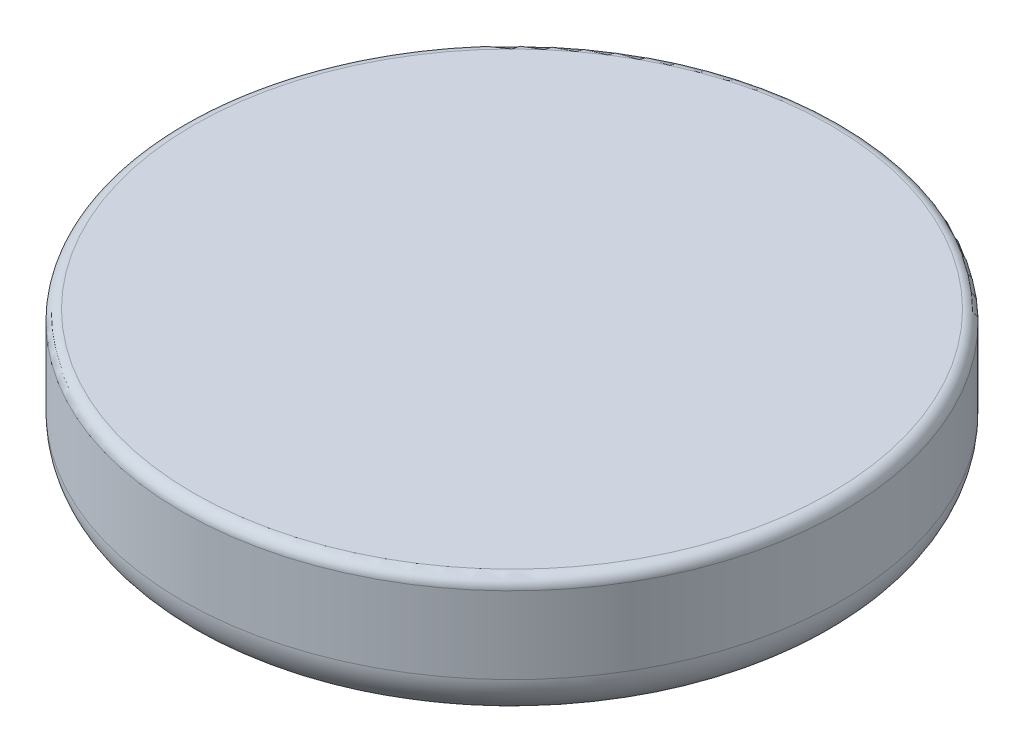
ISO-10303-21;
HEADER;
FILE_DESCRIPTION(('STEP AP214'),'2;1');
FILE_NAME('part.step','',(''),(''),'','','');
FILE_SCHEMA(('AUTOMOTIVE_DESIGN { 1 0 10303 214 1 1 1 1 }'));
ENDSEC;
DATA;
#1=APPLICATION_CONTEXT('core data for automotive mechanical design processes');
#2=APPLICATION_PROTOCOL_DEFINITION('international standard','automotive_design',2000,#1);
#3=PRODUCT_CONTEXT('',#1,'mechanical');
#4=PRODUCT('Part','Part','',(#3));
#5=PRODUCT_RELATED_PRODUCT_CATEGORY('part','',(#4));
#6=PRODUCT_DEFINITION_FORMATION('','',#4);
#7=PRODUCT_DEFINITION_CONTEXT('part definition',#1,'design');
#8=PRODUCT_DEFINITION('design','',#6,#7);
#9=PRODUCT_DEFINITION_SHAPE('','',#8);
#10=(LENGTH_UNIT() NAMED_UNIT(*) SI_UNIT(.MILLI.,.METRE.));
#11=(NAMED_UNIT(*) PLANE_ANGLE_UNIT() SI_UNIT($,.RADIAN.));
#12=(NAMED_UNIT(*) SI_UNIT($,.STERADIAN.) SOLID_ANGLE_UNIT());
#13=UNCERTAINTY_MEASURE_WITH_UNIT(LENGTH_MEASURE(1.E-05),#10,'distance_accuracy_value','');
#14=(GEOMETRIC_REPRESENTATION_CONTEXT(3) GLOBAL_UNCERTAINTY_ASSIGNED_CONTEXT((#13)) GLOBAL_UNIT_ASSIGNED_CONTEXT((#10,
#11,#12)) REPRESENTATION_CONTEXT('',''));
#15=CARTESIAN_POINT('',(0.,0.,0.));
#16=DIRECTION('',(0.,0.,1.));
#17=DIRECTION('',(1.,0.,0.));
#18=AXIS2_PLACEMENT_3D('',#15,#16,#17);
#19=CARTESIAN_POINT('',(0.,3.,0.));
#20=DIRECTION('',(0.,-1.,0.));
#21=DIRECTION('',(0.,0.,-1.));
#22=AXIS2_PLACEMENT_3D('',#19,#20,#21);
#23=CYLINDRICAL_SURFACE('',#22,7.5);
#24=CARTESIAN_POINT('',(0.,2.75,0.));
#25=DIRECTION('',(0.,1.,0.));
#26=DIRECTION('',(0.,0.,1.));
#27=AXIS2_PLACEMENT_3D('',#24,#25,#26);
#28=CIRCLE('',#27,7.5);
#29=CARTESIAN_POINT('',(0.,2.75,7.5));
#30=VERTEX_POINT('',#29);
#31=EDGE_CURVE('E156',#30,#30,#28,.F.);
#32=ORIENTED_EDGE('',*,*,#31,.T.);
#33=EDGE_LOOP('',(#32));
#34=FACE_BOUND('',#33,.T.);
#35=CARTESIAN_POINT('',(0.,1.,0.));
#36=DIRECTION('',(0.,1.,0.));
#37=DIRECTION('',(0.,0.,1.));
#38=AXIS2_PLACEMENT_3D('',#35,#36,#37);
#39=CIRCLE('',#38,7.5);
#40=CARTESIAN_POINT('',(0.,1.,7.5));
#41=VERTEX_POINT('',#40);
#42=EDGE_CURVE('E138',#41,#41,#39,.T.);
#43=ORIENTED_EDGE('',*,*,#42,.T.);
#44=EDGE_LOOP('',(#43));
#45=FACE_BOUND('',#44,.T.);
#46=ADVANCED_FACE('F43',(#34,#45),#23,.T.);
#47=CARTESIAN_POINT('',(0.,3.,0.));
#48=DIRECTION('',(0.,1.,0.));
#49=DIRECTION('',(0.,0.,1.));
#50=AXIS2_PLACEMENT_3D('',#47,#48,#49);
#51=PLANE('',#50);
#52=CARTESIAN_POINT('',(0.,3.,0.));
#53=DIRECTION('',(0.,1.,0.));
#54=DIRECTION('',(0.,0.,1.));
#55=AXIS2_PLACEMENT_3D('',#52,#53,#54);
#56=CIRCLE('',#55,7.25);
#57=CARTESIAN_POINT('',(0.,3.,7.25));
#58=VERTEX_POINT('',#57);
#59=EDGE_CURVE('E152',#58,#58,#56,.T.);
#60=ORIENTED_EDGE('',*,*,#59,.T.);
#61=EDGE_LOOP('',(#60));
#62=FACE_BOUND('',#61,.T.);
#63=ADVANCED_FACE('F197',(#62),#51,.T.);
#64=CARTESIAN_POINT('',(0.,0.,0.));
#65=DIRECTION('',(0.,1.,0.));
#66=DIRECTION('',(0.,0.,1.));
#67=AXIS2_PLACEMENT_3D('',#64,#65,#66);
#68=PLANE('',#67);
#69=DIRECTION('',(1.,0.,0.));
#70=VECTOR('',#69,1.);
#71=CARTESIAN_POINT('',(0.7,0.,-2.55));
#72=LINE('',#71,#70);
#73=CARTESIAN_POINT('',(-0.95,0.,-2.55));
#74=VERTEX_POINT('',#73);
#75=CARTESIAN_POINT('',(0.95,0.,-2.55));
#76=VERTEX_POINT('',#75);
#77=EDGE_CURVE('E126',#74,#76,#72,.T.);
#78=ORIENTED_EDGE('',*,*,#77,.F.);
#79=DIRECTION('',(0.,0.,-1.));
#80=VECTOR('',#79,1.);
#81=CARTESIAN_POINT('',(-0.95,0.,0.));
#82=LINE('',#81,#80);
#83=CARTESIAN_POINT('',(-0.950000000000001,0.,2.55));
#84=VERTEX_POINT('',#83);
#85=EDGE_CURVE('E166',#74,#84,#82,.F.);
#86=ORIENTED_EDGE('',*,*,#85,.T.);
#87=DIRECTION('',(-1.,0.,0.));
#88=VECTOR('',#87,1.);
#89=CARTESIAN_POINT('',(0.7,0.,2.55));
#90=LINE('',#89,#88);
#91=CARTESIAN_POINT('',(0.95,0.,2.55));
#92=VERTEX_POINT('',#91);
#93=EDGE_CURVE('E123',#92,#84,#90,.T.);
#94=ORIENTED_EDGE('',*,*,#93,.F.);
#95=DIRECTION('',(0.,0.,1.));
#96=VECTOR('',#95,1.);
#97=CARTESIAN_POINT('',(0.95,0.,0.));
#98=LINE('',#97,#96);
#99=EDGE_CURVE('E162',#92,#76,#98,.F.);
#100=ORIENTED_EDGE('',*,*,#99,.T.);
#101=EDGE_LOOP('',(#78,#86,#94,#100));
#102=FACE_BOUND('',#101,.T.);
#103=CARTESIAN_POINT('',(0.,0.,0.));
#104=DIRECTION('',(0.,1.,0.));
#105=DIRECTION('',(0.,0.,1.));
#106=AXIS2_PLACEMENT_3D('',#103,#104,#105);
#107=CIRCLE('',#106,6.5);
#108=CARTESIAN_POINT('',(0.,0.,6.5));
#109=VERTEX_POINT('',#108);
#110=EDGE_CURVE('E148',#109,#109,#107,.F.);
#111=ORIENTED_EDGE('',*,*,#110,.T.);
#112=EDGE_LOOP('',(#111));
#113=FACE_BOUND('',#112,.T.);
#114=ADVANCED_FACE('F182',(#102,#113),#68,.F.);
#115=CARTESIAN_POINT('',(0.,1.,0.));
#116=DIRECTION('',(0.,1.,0.));
#117=DIRECTION('',(0.,0.,1.));
#118=AXIS2_PLACEMENT_3D('',#115,#116,#117);
#119=TOROIDAL_SURFACE('',#118,6.5,1.);
#120=ORIENTED_EDGE('',*,*,#110,.F.);
#121=EDGE_LOOP('',(#120));
#122=FACE_BOUND('',#121,.T.);
#123=ORIENTED_EDGE('',*,*,#42,.F.);
#124=EDGE_LOOP('',(#123));
#125=FACE_BOUND('',#124,.T.);
#126=ADVANCED_FACE('F208',(#122,#125),#119,.T.);
#127=CARTESIAN_POINT('',(-0.700000000000001,2.,2.55));
#128=DIRECTION('',(-1.,0.,0.));
#129=DIRECTION('',(0.,0.,1.));
#130=AXIS2_PLACEMENT_3D('',#127,#128,#129);
#131=PLANE('',#130);
#132=DIRECTION('',(0.,-1.,0.));
#133=VECTOR('',#132,1.);
#134=CARTESIAN_POINT('',(-0.700000000000001,2.,2.55));
#135=LINE('',#134,#133);
#136=CARTESIAN_POINT('',(-0.700000000000001,2.,2.55));
#137=VERTEX_POINT('',#136);
#138=CARTESIAN_POINT('',(-0.700000000000001,0.25,2.55));
#139=VERTEX_POINT('',#138);
#140=EDGE_CURVE('E135',#137,#139,#135,.T.);
#141=ORIENTED_EDGE('',*,*,#140,.T.);
#142=DIRECTION('',(0.,0.,-1.));
#143=VECTOR('',#142,1.);
#144=CARTESIAN_POINT('',(-0.700000000000001,0.25,2.55));
#145=LINE('',#144,#143);
#146=CARTESIAN_POINT('',(-0.7,0.25,-2.55));
#147=VERTEX_POINT('',#146);
#148=EDGE_CURVE('E105',#139,#147,#145,.T.);
#149=ORIENTED_EDGE('',*,*,#148,.T.);
#150=DIRECTION('',(0.,-1.,0.));
#151=VECTOR('',#150,1.);
#152=CARTESIAN_POINT('',(-0.7,2.,-2.55));
#153=LINE('',#152,#151);
#154=CARTESIAN_POINT('',(-0.7,2.,-2.55));
#155=VERTEX_POINT('',#154);
#156=EDGE_CURVE('E97',#155,#147,#153,.T.);
#157=ORIENTED_EDGE('',*,*,#156,.F.);
#158=DIRECTION('',(0.,0.,-1.));
#159=VECTOR('',#158,1.);
#160=CARTESIAN_POINT('',(-0.700000000000001,2.,2.55));
#161=LINE('',#160,#159);
#162=EDGE_CURVE('E102',#137,#155,#161,.T.);
#163=ORIENTED_EDGE('',*,*,#162,.F.);
#164=EDGE_LOOP('',(#141,#149,#157,#163));
#165=FACE_BOUND('',#164,.T.);
#166=ADVANCED_FACE('F100',(#165),#131,.F.);
#167=CARTESIAN_POINT('',(0.7,2.,2.55));
#168=DIRECTION('',(0.,0.,1.));
#169=DIRECTION('',(1.,0.,0.));
#170=AXIS2_PLACEMENT_3D('',#167,#168,#169);
#171=PLANE('',#170);
#172=ORIENTED_EDGE('',*,*,#93,.T.);
#173=CARTESIAN_POINT('',(-0.950000000000001,0.25,2.55));
#174=DIRECTION('',(0.,0.,1.));
#175=DIRECTION('',(1.,0.,0.));
#176=AXIS2_PLACEMENT_3D('',#173,#174,#175);
#177=CIRCLE('',#176,0.25);
#178=EDGE_CURVE('E176',#84,#139,#177,.T.);
#179=ORIENTED_EDGE('',*,*,#178,.T.);
#180=ORIENTED_EDGE('',*,*,#140,.F.);
#181=DIRECTION('',(-1.,0.,0.));
#182=VECTOR('',#181,1.);
#183=CARTESIAN_POINT('',(0.7,2.,2.55));
#184=LINE('',#183,#182);
#185=CARTESIAN_POINT('',(0.7,2.,2.55));
#186=VERTEX_POINT('',#185);
#187=EDGE_CURVE('E109',#186,#137,#184,.T.);
#188=ORIENTED_EDGE('',*,*,#187,.F.);
#189=DIRECTION('',(0.,-1.,0.));
#190=VECTOR('',#189,1.);
#191=CARTESIAN_POINT('',(0.7,2.,2.55));
#192=LINE('',#191,#190);
#193=CARTESIAN_POINT('',(0.7,0.25,2.55));
#194=VERTEX_POINT('',#193);
#195=EDGE_CURVE('E139',#186,#194,#192,.T.);
#196=ORIENTED_EDGE('',*,*,#195,.T.);
#197=CARTESIAN_POINT('',(0.95,0.25,2.55));
#198=DIRECTION('',(0.,0.,1.));
#199=DIRECTION('',(1.,0.,0.));
#200=AXIS2_PLACEMENT_3D('',#197,#198,#199);
#201=CIRCLE('',#200,0.25);
#202=EDGE_CURVE('E52',#194,#92,#201,.T.);
#203=ORIENTED_EDGE('',*,*,#202,.T.);
#204=EDGE_LOOP('',(#172,#179,#180,#188,#196,#203));
#205=FACE_BOUND('',#204,.T.);
#206=ADVANCED_FACE('F180',(#205),#171,.F.);
#207=CARTESIAN_POINT('',(0.7,2.,2.55));
#208=DIRECTION('',(1.,0.,0.));
#209=DIRECTION('',(0.,0.,-1.));
#210=AXIS2_PLACEMENT_3D('',#207,#208,#209);
#211=PLANE('',#210);
#212=DIRECTION('',(0.,-1.,0.));
#213=VECTOR('',#212,1.);
#214=CARTESIAN_POINT('',(0.7,2.,-2.55));
#215=LINE('',#214,#213);
#216=CARTESIAN_POINT('',(0.7,2.,-2.55));
#217=VERTEX_POINT('',#216);
#218=CARTESIAN_POINT('',(0.7,0.25,-2.55));
#219=VERTEX_POINT('',#218);
#220=EDGE_CURVE('E108',#217,#219,#215,.T.);
#221=ORIENTED_EDGE('',*,*,#220,.T.);
#222=DIRECTION('',(0.,0.,1.));
#223=VECTOR('',#222,1.);
#224=CARTESIAN_POINT('',(0.7,0.25,2.55));
#225=LINE('',#224,#223);
#226=EDGE_CURVE('E170',#219,#194,#225,.T.);
#227=ORIENTED_EDGE('',*,*,#226,.T.);
#228=ORIENTED_EDGE('',*,*,#195,.F.);
#229=DIRECTION('',(0.,0.,1.));
#230=VECTOR('',#229,1.);
#231=CARTESIAN_POINT('',(0.7,2.,2.55));
#232=LINE('',#231,#230);
#233=EDGE_CURVE('E118',#217,#186,#232,.T.);
#234=ORIENTED_EDGE('',*,*,#233,.F.);
#235=EDGE_LOOP('',(#221,#227,#228,#234));
#236=FACE_BOUND('',#235,.T.);
#237=ADVANCED_FACE('F270',(#236),#211,.F.);
#238=CARTESIAN_POINT('',(0.7,2.,-2.55));
#239=DIRECTION('',(0.,0.,-1.));
#240=DIRECTION('',(-1.,0.,0.));
#241=AXIS2_PLACEMENT_3D('',#238,#239,#240);
#242=PLANE('',#241);
#243=ORIENTED_EDGE('',*,*,#77,.T.);
#244=CARTESIAN_POINT('',(0.95,0.25,-2.55));
#245=DIRECTION('',(0.,0.,-1.));
#246=DIRECTION('',(-1.,0.,0.));
#247=AXIS2_PLACEMENT_3D('',#244,#245,#246);
#248=CIRCLE('',#247,0.25);
#249=EDGE_CURVE('E11',#76,#219,#248,.T.);
#250=ORIENTED_EDGE('',*,*,#249,.T.);
#251=ORIENTED_EDGE('',*,*,#220,.F.);
#252=DIRECTION('',(1.,0.,0.));
#253=VECTOR('',#252,1.);
#254=CARTESIAN_POINT('',(0.7,2.,-2.55));
#255=LINE('',#254,#253);
#256=EDGE_CURVE('E112',#155,#217,#255,.T.);
#257=ORIENTED_EDGE('',*,*,#256,.F.);
#258=ORIENTED_EDGE('',*,*,#156,.T.);
#259=CARTESIAN_POINT('',(-0.95,0.25,-2.55));
#260=DIRECTION('',(0.,0.,-1.));
#261=DIRECTION('',(-1.,0.,0.));
#262=AXIS2_PLACEMENT_3D('',#259,#260,#261);
#263=CIRCLE('',#262,0.25);
#264=EDGE_CURVE('E173',#147,#74,#263,.T.);
#265=ORIENTED_EDGE('',*,*,#264,.T.);
#266=EDGE_LOOP('',(#243,#250,#251,#257,#258,#265));
#267=FACE_BOUND('',#266,.T.);
#268=ADVANCED_FACE('F113',(#267),#242,.F.);
#269=CARTESIAN_POINT('',(0.,2.,0.));
#270=DIRECTION('',(0.,1.,0.));
#271=DIRECTION('',(0.,0.,1.));
#272=AXIS2_PLACEMENT_3D('',#269,#270,#271);
#273=PLANE('',#272);
#274=ORIENTED_EDGE('',*,*,#162,.T.);
#275=ORIENTED_EDGE('',*,*,#256,.T.);
#276=ORIENTED_EDGE('',*,*,#233,.T.);
#277=ORIENTED_EDGE('',*,*,#187,.T.);
#278=EDGE_LOOP('',(#274,#275,#276,#277));
#279=FACE_BOUND('',#278,.T.);
#280=ADVANCED_FACE('F120',(#279),#273,.F.);
#281=CARTESIAN_POINT('',(0.,2.75,0.));
#282=DIRECTION('',(0.,1.,0.));
#283=DIRECTION('',(0.,0.,1.));
#284=AXIS2_PLACEMENT_3D('',#281,#282,#283);
#285=TOROIDAL_SURFACE('',#284,7.25,0.25);
#286=ORIENTED_EDGE('',*,*,#31,.F.);
#287=EDGE_LOOP('',(#286));
#288=FACE_BOUND('',#287,.T.);
#289=ORIENTED_EDGE('',*,*,#59,.F.);
#290=EDGE_LOOP('',(#289));
#291=FACE_BOUND('',#290,.T.);
#292=ADVANCED_FACE('F189',(#288,#291),#285,.T.);
#293=CARTESIAN_POINT('',(-0.950000000000001,0.25,2.55));
#294=DIRECTION('',(0.,0.,-1.));
#295=DIRECTION('',(-1.,0.,0.));
#296=AXIS2_PLACEMENT_3D('',#293,#294,#295);
#297=CYLINDRICAL_SURFACE('',#296,0.25);
#298=ORIENTED_EDGE('',*,*,#178,.F.);
#299=ORIENTED_EDGE('',*,*,#85,.F.);
#300=ORIENTED_EDGE('',*,*,#264,.F.);
#301=ORIENTED_EDGE('',*,*,#148,.F.);
#302=EDGE_LOOP('',(#298,#299,#300,#301));
#303=FACE_BOUND('',#302,.T.);
#304=ADVANCED_FACE('F187',(#303),#297,.T.);
#305=CARTESIAN_POINT('',(0.95,0.25,2.55));
#306=DIRECTION('',(0.,0.,1.));
#307=DIRECTION('',(1.,0.,0.));
#308=AXIS2_PLACEMENT_3D('',#305,#306,#307);
#309=CYLINDRICAL_SURFACE('',#308,0.25);
#310=ORIENTED_EDGE('',*,*,#249,.F.);
#311=ORIENTED_EDGE('',*,*,#99,.F.);
#312=ORIENTED_EDGE('',*,*,#202,.F.);
#313=ORIENTED_EDGE('',*,*,#226,.F.);
#314=EDGE_LOOP('',(#310,#311,#312,#313));
#315=FACE_BOUND('',#314,.T.);
#316=ADVANCED_FACE('F45',(#315),#309,.T.);
#317=CLOSED_SHELL('',(#46,#63,#114,#126,#166,#206,#237,#268,#280,#292,#304,#316));
#318=MANIFOLD_SOLID_BREP('B2',#317);
#319=ADVANCED_BREP_SHAPE_REPRESENTATION('',(#18,#318),#14);
#320=SHAPE_DEFINITION_REPRESENTATION(#9,#319);
ENDSEC;
END-ISO-10303-21;
